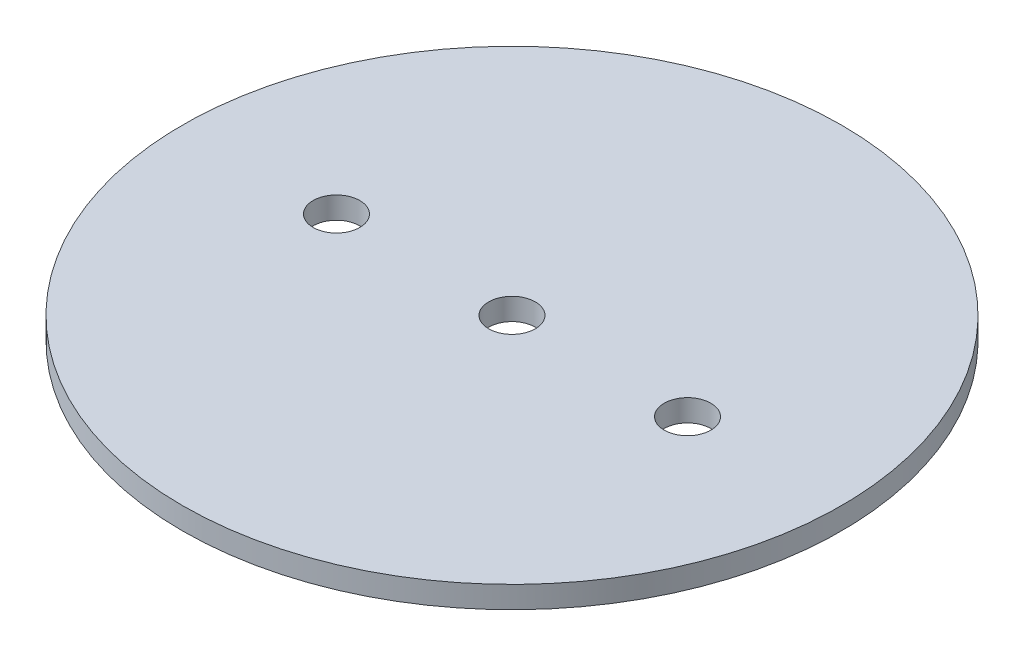
ISO-10303-21;
HEADER;
FILE_DESCRIPTION(('STEP AP214'),'2;1');
FILE_NAME('part.step','',(''),(''),'','','');
FILE_SCHEMA(('AUTOMOTIVE_DESIGN { 1 0 10303 214 1 1 1 1 }'));
ENDSEC;
DATA;
#1=APPLICATION_CONTEXT('core data for automotive mechanical design processes');
#2=APPLICATION_PROTOCOL_DEFINITION('international standard','automotive_design',2000,#1);
#3=PRODUCT_CONTEXT('',#1,'mechanical');
#4=PRODUCT('Part','Part','',(#3));
#5=PRODUCT_RELATED_PRODUCT_CATEGORY('part','',(#4));
#6=PRODUCT_DEFINITION_FORMATION('','',#4);
#7=PRODUCT_DEFINITION_CONTEXT('part definition',#1,'design');
#8=PRODUCT_DEFINITION('design','',#6,#7);
#9=PRODUCT_DEFINITION_SHAPE('','',#8);
#10=(LENGTH_UNIT() NAMED_UNIT(*) SI_UNIT(.MILLI.,.METRE.));
#11=(NAMED_UNIT(*) PLANE_ANGLE_UNIT() SI_UNIT($,.RADIAN.));
#12=(NAMED_UNIT(*) SI_UNIT($,.STERADIAN.) SOLID_ANGLE_UNIT());
#13=UNCERTAINTY_MEASURE_WITH_UNIT(LENGTH_MEASURE(1.E-05),#10,'distance_accuracy_value','');
#14=(GEOMETRIC_REPRESENTATION_CONTEXT(3) GLOBAL_UNCERTAINTY_ASSIGNED_CONTEXT((#13)) GLOBAL_UNIT_ASSIGNED_CONTEXT((#10,
#11,#12)) REPRESENTATION_CONTEXT('',''));
#15=CARTESIAN_POINT('',(0.,0.,0.));
#16=DIRECTION('',(0.,0.,1.));
#17=DIRECTION('',(1.,0.,0.));
#18=AXIS2_PLACEMENT_3D('',#15,#16,#17);
#19=CARTESIAN_POINT('',(0.,3.175,0.));
#20=DIRECTION('',(0.,-1.,0.));
#21=DIRECTION('',(0.,0.,-1.));
#22=AXIS2_PLACEMENT_3D('',#19,#20,#21);
#23=CYLINDRICAL_SURFACE('',#22,47.6885);
#24=CARTESIAN_POINT('',(0.,3.175,0.));
#25=DIRECTION('',(0.,1.,0.));
#26=DIRECTION('',(0.,0.,1.));
#27=AXIS2_PLACEMENT_3D('',#24,#25,#26);
#28=CIRCLE('',#27,47.6885);
#29=CARTESIAN_POINT('',(0.,3.175,47.6885));
#30=VERTEX_POINT('',#29);
#31=EDGE_CURVE('E10',#30,#30,#28,.T.);
#32=ORIENTED_EDGE('',*,*,#31,.F.);
#33=EDGE_LOOP('',(#32));
#34=FACE_BOUND('',#33,.T.);
#35=CARTESIAN_POINT('',(0.,0.,0.));
#36=DIRECTION('',(0.,1.,0.));
#37=DIRECTION('',(0.,0.,1.));
#38=AXIS2_PLACEMENT_3D('',#35,#36,#37);
#39=CIRCLE('',#38,47.6885);
#40=CARTESIAN_POINT('',(0.,0.,47.6885));
#41=VERTEX_POINT('',#40);
#42=EDGE_CURVE('E46',#41,#41,#39,.T.);
#43=ORIENTED_EDGE('',*,*,#42,.T.);
#44=EDGE_LOOP('',(#43));
#45=FACE_BOUND('',#44,.T.);
#46=ADVANCED_FACE('F43',(#34,#45),#23,.T.);
#47=CARTESIAN_POINT('',(0.,3.175,0.));
#48=DIRECTION('',(0.,1.,0.));
#49=DIRECTION('',(0.,0.,1.));
#50=AXIS2_PLACEMENT_3D('',#47,#48,#49);
#51=PLANE('',#50);
#52=CARTESIAN_POINT('',(-25.4,3.175,0.));
#53=DIRECTION('',(0.,1.,0.));
#54=DIRECTION('',(0.,0.,1.));
#55=AXIS2_PLACEMENT_3D('',#52,#53,#54);
#56=CIRCLE('',#55,3.37819999999999);
#57=CARTESIAN_POINT('',(-25.4,3.175,3.37819999999999));
#58=VERTEX_POINT('',#57);
#59=EDGE_CURVE('E76',#58,#58,#56,.T.);
#60=ORIENTED_EDGE('',*,*,#59,.F.);
#61=EDGE_LOOP('',(#60));
#62=FACE_BOUND('',#61,.T.);
#63=CARTESIAN_POINT('',(25.4,3.175,0.));
#64=DIRECTION('',(0.,1.,0.));
#65=DIRECTION('',(0.,0.,1.));
#66=AXIS2_PLACEMENT_3D('',#63,#64,#65);
#67=CIRCLE('',#66,3.37819999999999);
#68=CARTESIAN_POINT('',(25.4,3.175,3.37819999999998));
#69=VERTEX_POINT('',#68);
#70=EDGE_CURVE('E68',#69,#69,#67,.T.);
#71=ORIENTED_EDGE('',*,*,#70,.F.);
#72=EDGE_LOOP('',(#71));
#73=FACE_BOUND('',#72,.T.);
#74=CARTESIAN_POINT('',(0.,3.175,0.));
#75=DIRECTION('',(0.,1.,0.));
#76=DIRECTION('',(0.,0.,1.));
#77=AXIS2_PLACEMENT_3D('',#74,#75,#76);
#78=CIRCLE('',#77,3.37819999999999);
#79=CARTESIAN_POINT('',(0.,3.175,3.37819999999999));
#80=VERTEX_POINT('',#79);
#81=EDGE_CURVE('E60',#80,#80,#78,.T.);
#82=ORIENTED_EDGE('',*,*,#81,.F.);
#83=EDGE_LOOP('',(#82));
#84=FACE_BOUND('',#83,.T.);
#85=ORIENTED_EDGE('',*,*,#31,.T.);
#86=EDGE_LOOP('',(#85));
#87=FACE_BOUND('',#86,.T.);
#88=ADVANCED_FACE('F83',(#62,#73,#84,#87),#51,.T.);
#89=CARTESIAN_POINT('',(0.,0.,0.));
#90=DIRECTION('',(0.,1.,0.));
#91=DIRECTION('',(0.,0.,1.));
#92=AXIS2_PLACEMENT_3D('',#89,#90,#91);
#93=PLANE('',#92);
#94=CARTESIAN_POINT('',(-25.4,0.,0.));
#95=DIRECTION('',(0.,1.,0.));
#96=DIRECTION('',(0.,0.,1.));
#97=AXIS2_PLACEMENT_3D('',#94,#95,#96);
#98=CIRCLE('',#97,3.37819999999999);
#99=CARTESIAN_POINT('',(-25.4,0.,3.37819999999999));
#100=VERTEX_POINT('',#99);
#101=EDGE_CURVE('E72',#100,#100,#98,.T.);
#102=ORIENTED_EDGE('',*,*,#101,.T.);
#103=EDGE_LOOP('',(#102));
#104=FACE_BOUND('',#103,.T.);
#105=CARTESIAN_POINT('',(25.4,0.,0.));
#106=DIRECTION('',(0.,1.,0.));
#107=DIRECTION('',(0.,0.,1.));
#108=AXIS2_PLACEMENT_3D('',#105,#106,#107);
#109=CIRCLE('',#108,3.37819999999999);
#110=CARTESIAN_POINT('',(25.4,0.,3.37819999999998));
#111=VERTEX_POINT('',#110);
#112=EDGE_CURVE('E64',#111,#111,#109,.T.);
#113=ORIENTED_EDGE('',*,*,#112,.T.);
#114=EDGE_LOOP('',(#113));
#115=FACE_BOUND('',#114,.T.);
#116=CARTESIAN_POINT('',(0.,0.,0.));
#117=DIRECTION('',(0.,1.,0.));
#118=DIRECTION('',(0.,0.,1.));
#119=AXIS2_PLACEMENT_3D('',#116,#117,#118);
#120=CIRCLE('',#119,3.37819999999999);
#121=CARTESIAN_POINT('',(0.,0.,3.37819999999999));
#122=VERTEX_POINT('',#121);
#123=EDGE_CURVE('E55',#122,#122,#120,.T.);
#124=ORIENTED_EDGE('',*,*,#123,.T.);
#125=EDGE_LOOP('',(#124));
#126=FACE_BOUND('',#125,.T.);
#127=ORIENTED_EDGE('',*,*,#42,.F.);
#128=EDGE_LOOP('',(#127));
#129=FACE_BOUND('',#128,.T.);
#130=ADVANCED_FACE('F86',(#104,#115,#126,#129),#93,.F.);
#131=CARTESIAN_POINT('',(0.,3.175,0.));
#132=DIRECTION('',(0.,1.,0.));
#133=DIRECTION('',(0.,0.,1.));
#134=AXIS2_PLACEMENT_3D('',#131,#132,#133);
#135=CYLINDRICAL_SURFACE('',#134,3.37819999999999);
#136=ORIENTED_EDGE('',*,*,#123,.F.);
#137=EDGE_LOOP('',(#136));
#138=FACE_BOUND('',#137,.T.);
#139=ORIENTED_EDGE('',*,*,#81,.T.);
#140=EDGE_LOOP('',(#139));
#141=FACE_BOUND('',#140,.T.);
#142=ADVANCED_FACE('F92',(#138,#141),#135,.F.);
#143=CARTESIAN_POINT('',(25.4,3.175,0.));
#144=DIRECTION('',(0.,1.,0.));
#145=DIRECTION('',(0.,0.,1.));
#146=AXIS2_PLACEMENT_3D('',#143,#144,#145);
#147=CYLINDRICAL_SURFACE('',#146,3.37819999999999);
#148=ORIENTED_EDGE('',*,*,#112,.F.);
#149=EDGE_LOOP('',(#148));
#150=FACE_BOUND('',#149,.T.);
#151=ORIENTED_EDGE('',*,*,#70,.T.);
#152=EDGE_LOOP('',(#151));
#153=FACE_BOUND('',#152,.T.);
#154=ADVANCED_FACE('F94',(#150,#153),#147,.F.);
#155=CARTESIAN_POINT('',(-25.4,3.175,0.));
#156=DIRECTION('',(0.,1.,0.));
#157=DIRECTION('',(0.,0.,1.));
#158=AXIS2_PLACEMENT_3D('',#155,#156,#157);
#159=CYLINDRICAL_SURFACE('',#158,3.37819999999999);
#160=ORIENTED_EDGE('',*,*,#101,.F.);
#161=EDGE_LOOP('',(#160));
#162=FACE_BOUND('',#161,.T.);
#163=ORIENTED_EDGE('',*,*,#59,.T.);
#164=EDGE_LOOP('',(#163));
#165=FACE_BOUND('',#164,.T.);
#166=ADVANCED_FACE('F81',(#162,#165),#159,.F.);
#167=CLOSED_SHELL('',(#46,#88,#130,#142,#154,#166));
#168=MANIFOLD_SOLID_BREP('B2',#167);
#169=ADVANCED_BREP_SHAPE_REPRESENTATION('',(#18,#168),#14);
#170=SHAPE_DEFINITION_REPRESENTATION(#9,#169);
ENDSEC;
END-ISO-10303-21;
